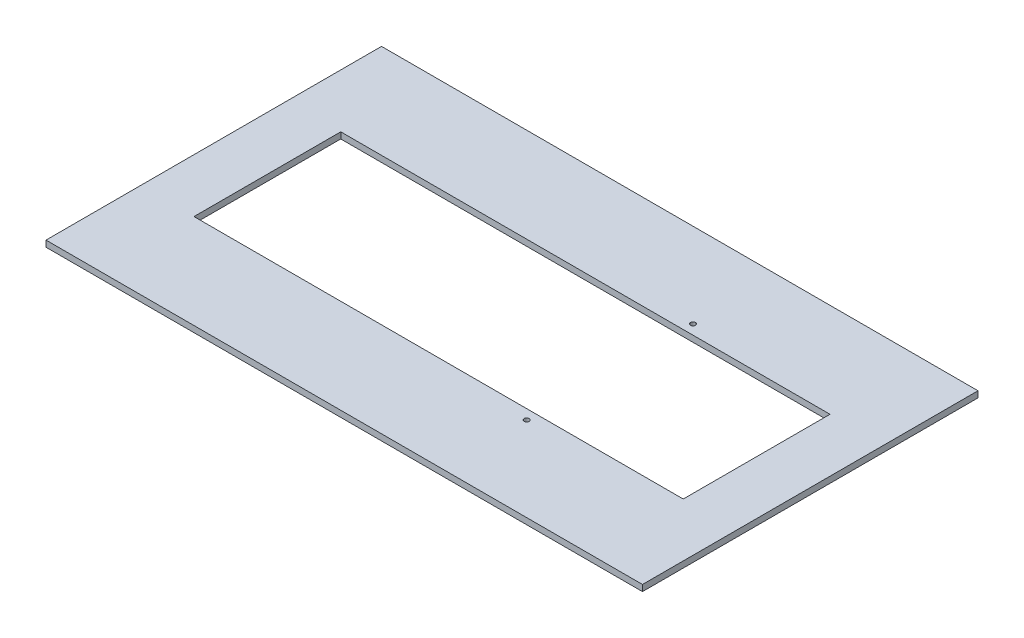
ISO-10303-21;
HEADER;
FILE_DESCRIPTION(('STEP AP214'),'2;1');
FILE_NAME('part.step','',(''),(''),'','','');
FILE_SCHEMA(('AUTOMOTIVE_DESIGN { 1 0 10303 214 1 1 1 1 }'));
ENDSEC;
DATA;
#1=APPLICATION_CONTEXT('core data for automotive mechanical design processes');
#2=APPLICATION_PROTOCOL_DEFINITION('international standard','automotive_design',2000,#1);
#3=PRODUCT_CONTEXT('',#1,'mechanical');
#4=PRODUCT('Part','Part','',(#3));
#5=PRODUCT_RELATED_PRODUCT_CATEGORY('part','',(#4));
#6=PRODUCT_DEFINITION_FORMATION('','',#4);
#7=PRODUCT_DEFINITION_CONTEXT('part definition',#1,'design');
#8=PRODUCT_DEFINITION('design','',#6,#7);
#9=PRODUCT_DEFINITION_SHAPE('','',#8);
#10=(LENGTH_UNIT() NAMED_UNIT(*) SI_UNIT(.MILLI.,.METRE.));
#11=(NAMED_UNIT(*) PLANE_ANGLE_UNIT() SI_UNIT($,.RADIAN.));
#12=(NAMED_UNIT(*) SI_UNIT($,.STERADIAN.) SOLID_ANGLE_UNIT());
#13=UNCERTAINTY_MEASURE_WITH_UNIT(LENGTH_MEASURE(1.E-05),#10,'distance_accuracy_value','');
#14=(GEOMETRIC_REPRESENTATION_CONTEXT(3) GLOBAL_UNCERTAINTY_ASSIGNED_CONTEXT((#13)) GLOBAL_UNIT_ASSIGNED_CONTEXT((#10,
#11,#12)) REPRESENTATION_CONTEXT('',''));
#15=CARTESIAN_POINT('',(0.,0.,0.));
#16=DIRECTION('',(0.,0.,1.));
#17=DIRECTION('',(1.,0.,0.));
#18=AXIS2_PLACEMENT_3D('',#15,#16,#17);
#19=CARTESIAN_POINT('',(0.,6.35,0.));
#20=DIRECTION('',(0.,-1.,0.));
#21=DIRECTION('',(0.,0.,-1.));
#22=AXIS2_PLACEMENT_3D('',#19,#20,#21);
#23=PLANE('',#22);
#24=DIRECTION('',(0.,0.,1.));
#25=VECTOR('',#24,1.);
#26=CARTESIAN_POINT('',(0.,6.35,0.));
#27=LINE('',#26,#25);
#28=CARTESIAN_POINT('',(1.50524556773939E-13,6.35,-342.9));
#29=VERTEX_POINT('',#28);
#30=CARTESIAN_POINT('',(0.,6.35,0.));
#31=VERTEX_POINT('',#30);
#32=EDGE_CURVE('E162',#29,#31,#27,.T.);
#33=ORIENTED_EDGE('',*,*,#32,.T.);
#34=DIRECTION('',(1.,0.,0.));
#35=VECTOR('',#34,1.);
#36=CARTESIAN_POINT('',(0.,6.35,0.));
#37=LINE('',#36,#35);
#38=CARTESIAN_POINT('',(609.6,6.35,0.));
#39=VERTEX_POINT('',#38);
#40=EDGE_CURVE('E166',#31,#39,#37,.T.);
#41=ORIENTED_EDGE('',*,*,#40,.T.);
#42=DIRECTION('',(0.,0.,-1.));
#43=VECTOR('',#42,1.);
#44=CARTESIAN_POINT('',(609.6,6.35,0.));
#45=LINE('',#44,#43);
#46=CARTESIAN_POINT('',(609.6,6.35,-342.9));
#47=VERTEX_POINT('',#46);
#48=EDGE_CURVE('E170',#39,#47,#45,.T.);
#49=ORIENTED_EDGE('',*,*,#48,.T.);
#50=DIRECTION('',(-1.,0.,0.));
#51=VECTOR('',#50,1.);
#52=CARTESIAN_POINT('',(1.50524556773939E-13,6.35,-342.9));
#53=LINE('',#52,#51);
#54=EDGE_CURVE('E173',#47,#29,#53,.T.);
#55=ORIENTED_EDGE('',*,*,#54,.T.);
#56=EDGE_LOOP('',(#33,#41,#49,#55));
#57=FACE_BOUND('',#56,.T.);
#58=DIRECTION('',(0.,0.,1.));
#59=VECTOR('',#58,1.);
#60=CARTESIAN_POINT('',(54.8,6.35,-246.45));
#61=LINE('',#60,#59);
#62=CARTESIAN_POINT('',(54.8,6.35,-246.45));
#63=VERTEX_POINT('',#62);
#64=CARTESIAN_POINT('',(54.8,6.35,-96.4499999999999));
#65=VERTEX_POINT('',#64);
#66=EDGE_CURVE('E111',#63,#65,#61,.T.);
#67=ORIENTED_EDGE('',*,*,#66,.F.);
#68=DIRECTION('',(-1.,0.,0.));
#69=VECTOR('',#68,1.);
#70=CARTESIAN_POINT('',(54.8,6.35,-246.45));
#71=LINE('',#70,#69);
#72=CARTESIAN_POINT('',(554.8,6.35,-246.45));
#73=VERTEX_POINT('',#72);
#74=EDGE_CURVE('E138',#73,#63,#71,.T.);
#75=ORIENTED_EDGE('',*,*,#74,.F.);
#76=DIRECTION('',(0.,0.,-1.));
#77=VECTOR('',#76,1.);
#78=CARTESIAN_POINT('',(554.8,6.35,-246.45));
#79=LINE('',#78,#77);
#80=CARTESIAN_POINT('',(554.8,6.35,-96.45));
#81=VERTEX_POINT('',#80);
#82=EDGE_CURVE('E134',#81,#73,#79,.T.);
#83=ORIENTED_EDGE('',*,*,#82,.F.);
#84=DIRECTION('',(1.,0.,0.));
#85=VECTOR('',#84,1.);
#86=CARTESIAN_POINT('',(54.8,6.35,-96.4499999999999));
#87=LINE('',#86,#85);
#88=EDGE_CURVE('E120',#65,#81,#87,.T.);
#89=ORIENTED_EDGE('',*,*,#88,.F.);
#90=EDGE_LOOP('',(#67,#75,#83,#89));
#91=FACE_BOUND('',#90,.T.);
#92=CARTESIAN_POINT('',(404.8,6.35,-256.45));
#93=DIRECTION('',(0.,1.,0.));
#94=DIRECTION('',(0.,0.,1.));
#95=AXIS2_PLACEMENT_3D('',#92,#93,#94);
#96=CIRCLE('',#95,2.55499999999998);
#97=CARTESIAN_POINT('',(404.8,6.35,-253.895));
#98=VERTEX_POINT('',#97);
#99=EDGE_CURVE('E146',#98,#98,#96,.T.);
#100=ORIENTED_EDGE('',*,*,#99,.F.);
#101=EDGE_LOOP('',(#100));
#102=FACE_BOUND('',#101,.T.);
#103=CARTESIAN_POINT('',(404.8,6.35,-86.4499999999999));
#104=DIRECTION('',(0.,1.,0.));
#105=DIRECTION('',(0.,0.,1.));
#106=AXIS2_PLACEMENT_3D('',#103,#104,#105);
#107=CIRCLE('',#106,2.55499999999998);
#108=CARTESIAN_POINT('',(404.8,6.35,-83.895));
#109=VERTEX_POINT('',#108);
#110=EDGE_CURVE('E262',#109,#109,#107,.T.);
#111=ORIENTED_EDGE('',*,*,#110,.F.);
#112=EDGE_LOOP('',(#111));
#113=FACE_BOUND('',#112,.T.);
#114=ADVANCED_FACE('F45',(#57,#91,#102,#113),#23,.F.);
#115=CARTESIAN_POINT('',(0.,0.,0.));
#116=DIRECTION('',(0.,-1.,0.));
#117=DIRECTION('',(0.,0.,-1.));
#118=AXIS2_PLACEMENT_3D('',#115,#116,#117);
#119=PLANE('',#118);
#120=CARTESIAN_POINT('',(404.8,0.,-256.45));
#121=DIRECTION('',(0.,1.,0.));
#122=DIRECTION('',(0.,0.,1.));
#123=AXIS2_PLACEMENT_3D('',#120,#121,#122);
#124=CIRCLE('',#123,2.55499999999998);
#125=CARTESIAN_POINT('',(404.8,0.,-253.895));
#126=VERTEX_POINT('',#125);
#127=EDGE_CURVE('E270',#126,#126,#124,.T.);
#128=ORIENTED_EDGE('',*,*,#127,.T.);
#129=EDGE_LOOP('',(#128));
#130=FACE_BOUND('',#129,.T.);
#131=DIRECTION('',(0.,0.,1.));
#132=VECTOR('',#131,1.);
#133=CARTESIAN_POINT('',(0.,0.,0.));
#134=LINE('',#133,#132);
#135=CARTESIAN_POINT('',(1.50524556773939E-13,0.,-342.9));
#136=VERTEX_POINT('',#135);
#137=CARTESIAN_POINT('',(0.,0.,0.));
#138=VERTEX_POINT('',#137);
#139=EDGE_CURVE('E129',#136,#138,#134,.T.);
#140=ORIENTED_EDGE('',*,*,#139,.F.);
#141=DIRECTION('',(-1.,0.,0.));
#142=VECTOR('',#141,1.);
#143=CARTESIAN_POINT('',(1.50524556773939E-13,0.,-342.9));
#144=LINE('',#143,#142);
#145=CARTESIAN_POINT('',(609.6,0.,-342.9));
#146=VERTEX_POINT('',#145);
#147=EDGE_CURVE('E167',#146,#136,#144,.T.);
#148=ORIENTED_EDGE('',*,*,#147,.F.);
#149=DIRECTION('',(0.,0.,-1.));
#150=VECTOR('',#149,1.);
#151=CARTESIAN_POINT('',(609.6,0.,0.));
#152=LINE('',#151,#150);
#153=CARTESIAN_POINT('',(609.6,0.,0.));
#154=VERTEX_POINT('',#153);
#155=EDGE_CURVE('E183',#154,#146,#152,.T.);
#156=ORIENTED_EDGE('',*,*,#155,.F.);
#157=DIRECTION('',(1.,0.,0.));
#158=VECTOR('',#157,1.);
#159=CARTESIAN_POINT('',(0.,0.,0.));
#160=LINE('',#159,#158);
#161=EDGE_CURVE('E180',#138,#154,#160,.T.);
#162=ORIENTED_EDGE('',*,*,#161,.F.);
#163=EDGE_LOOP('',(#140,#148,#156,#162));
#164=FACE_BOUND('',#163,.T.);
#165=DIRECTION('',(-1.,0.,0.));
#166=VECTOR('',#165,1.);
#167=CARTESIAN_POINT('',(54.8,0.,-246.45));
#168=LINE('',#167,#166);
#169=CARTESIAN_POINT('',(554.8,0.,-246.45));
#170=VERTEX_POINT('',#169);
#171=CARTESIAN_POINT('',(54.8,0.,-246.45));
#172=VERTEX_POINT('',#171);
#173=EDGE_CURVE('E121',#170,#172,#168,.T.);
#174=ORIENTED_EDGE('',*,*,#173,.T.);
#175=DIRECTION('',(0.,0.,1.));
#176=VECTOR('',#175,1.);
#177=CARTESIAN_POINT('',(54.8,0.,-246.45));
#178=LINE('',#177,#176);
#179=CARTESIAN_POINT('',(54.8,0.,-96.4499999999999));
#180=VERTEX_POINT('',#179);
#181=EDGE_CURVE('E69',#172,#180,#178,.T.);
#182=ORIENTED_EDGE('',*,*,#181,.T.);
#183=DIRECTION('',(1.,0.,0.));
#184=VECTOR('',#183,1.);
#185=CARTESIAN_POINT('',(54.8,0.,-96.4499999999999));
#186=LINE('',#185,#184);
#187=CARTESIAN_POINT('',(554.8,0.,-96.45));
#188=VERTEX_POINT('',#187);
#189=EDGE_CURVE('E127',#180,#188,#186,.T.);
#190=ORIENTED_EDGE('',*,*,#189,.T.);
#191=DIRECTION('',(0.,0.,-1.));
#192=VECTOR('',#191,1.);
#193=CARTESIAN_POINT('',(554.8,0.,-246.45));
#194=LINE('',#193,#192);
#195=EDGE_CURVE('E149',#188,#170,#194,.T.);
#196=ORIENTED_EDGE('',*,*,#195,.T.);
#197=EDGE_LOOP('',(#174,#182,#190,#196));
#198=FACE_BOUND('',#197,.T.);
#199=CARTESIAN_POINT('',(404.8,0.,-86.4499999999999));
#200=DIRECTION('',(0.,1.,0.));
#201=DIRECTION('',(0.,0.,1.));
#202=AXIS2_PLACEMENT_3D('',#199,#200,#201);
#203=CIRCLE('',#202,2.55499999999998);
#204=CARTESIAN_POINT('',(404.8,0.,-83.895));
#205=VERTEX_POINT('',#204);
#206=EDGE_CURVE('E265',#205,#205,#203,.T.);
#207=ORIENTED_EDGE('',*,*,#206,.T.);
#208=EDGE_LOOP('',(#207));
#209=FACE_BOUND('',#208,.T.);
#210=ADVANCED_FACE('F206',(#130,#164,#198,#209),#119,.T.);
#211=CARTESIAN_POINT('',(0.,6.35,0.));
#212=DIRECTION('',(1.,0.,0.));
#213=DIRECTION('',(0.,0.,-1.));
#214=AXIS2_PLACEMENT_3D('',#211,#212,#213);
#215=PLANE('',#214);
#216=ORIENTED_EDGE('',*,*,#139,.T.);
#217=DIRECTION('',(0.,-1.,0.));
#218=VECTOR('',#217,1.);
#219=CARTESIAN_POINT('',(0.,6.35,0.));
#220=LINE('',#219,#218);
#221=EDGE_CURVE('E11',#31,#138,#220,.T.);
#222=ORIENTED_EDGE('',*,*,#221,.F.);
#223=ORIENTED_EDGE('',*,*,#32,.F.);
#224=DIRECTION('',(0.,-1.,0.));
#225=VECTOR('',#224,1.);
#226=CARTESIAN_POINT('',(1.50524556773939E-13,6.35,-342.9));
#227=LINE('',#226,#225);
#228=EDGE_CURVE('E176',#29,#136,#227,.T.);
#229=ORIENTED_EDGE('',*,*,#228,.T.);
#230=EDGE_LOOP('',(#216,#222,#223,#229));
#231=FACE_BOUND('',#230,.T.);
#232=ADVANCED_FACE('F47',(#231),#215,.F.);
#233=CARTESIAN_POINT('',(0.,6.35,0.));
#234=DIRECTION('',(0.,0.,-1.));
#235=DIRECTION('',(-1.,0.,0.));
#236=AXIS2_PLACEMENT_3D('',#233,#234,#235);
#237=PLANE('',#236);
#238=ORIENTED_EDGE('',*,*,#161,.T.);
#239=DIRECTION('',(0.,-1.,0.));
#240=VECTOR('',#239,1.);
#241=CARTESIAN_POINT('',(609.6,6.35,0.));
#242=LINE('',#241,#240);
#243=EDGE_CURVE('E54',#39,#154,#242,.T.);
#244=ORIENTED_EDGE('',*,*,#243,.F.);
#245=ORIENTED_EDGE('',*,*,#40,.F.);
#246=ORIENTED_EDGE('',*,*,#221,.T.);
#247=EDGE_LOOP('',(#238,#244,#245,#246));
#248=FACE_BOUND('',#247,.T.);
#249=ADVANCED_FACE('F216',(#248),#237,.F.);
#250=CARTESIAN_POINT('',(609.6,6.35,0.));
#251=DIRECTION('',(-1.,0.,0.));
#252=DIRECTION('',(0.,0.,1.));
#253=AXIS2_PLACEMENT_3D('',#250,#251,#252);
#254=PLANE('',#253);
#255=ORIENTED_EDGE('',*,*,#155,.T.);
#256=DIRECTION('',(0.,-1.,0.));
#257=VECTOR('',#256,1.);
#258=CARTESIAN_POINT('',(609.6,6.35,-342.9));
#259=LINE('',#258,#257);
#260=EDGE_CURVE('E191',#47,#146,#259,.T.);
#261=ORIENTED_EDGE('',*,*,#260,.F.);
#262=ORIENTED_EDGE('',*,*,#48,.F.);
#263=ORIENTED_EDGE('',*,*,#243,.T.);
#264=EDGE_LOOP('',(#255,#261,#262,#263));
#265=FACE_BOUND('',#264,.T.);
#266=ADVANCED_FACE('F200',(#265),#254,.F.);
#267=CARTESIAN_POINT('',(1.50524556773939E-13,6.35,-342.9));
#268=DIRECTION('',(0.,0.,1.));
#269=DIRECTION('',(1.,0.,0.));
#270=AXIS2_PLACEMENT_3D('',#267,#268,#269);
#271=PLANE('',#270);
#272=ORIENTED_EDGE('',*,*,#147,.T.);
#273=ORIENTED_EDGE('',*,*,#228,.F.);
#274=ORIENTED_EDGE('',*,*,#54,.F.);
#275=ORIENTED_EDGE('',*,*,#260,.T.);
#276=EDGE_LOOP('',(#272,#273,#274,#275));
#277=FACE_BOUND('',#276,.T.);
#278=ADVANCED_FACE('F210',(#277),#271,.F.);
#279=CARTESIAN_POINT('',(54.8,6.35,-246.45));
#280=DIRECTION('',(1.,0.,0.));
#281=DIRECTION('',(0.,0.,-1.));
#282=AXIS2_PLACEMENT_3D('',#279,#280,#281);
#283=PLANE('',#282);
#284=ORIENTED_EDGE('',*,*,#181,.F.);
#285=DIRECTION('',(0.,-1.,0.));
#286=VECTOR('',#285,1.);
#287=CARTESIAN_POINT('',(54.8,6.35,-246.45));
#288=LINE('',#287,#286);
#289=EDGE_CURVE('E115',#63,#172,#288,.T.);
#290=ORIENTED_EDGE('',*,*,#289,.F.);
#291=ORIENTED_EDGE('',*,*,#66,.T.);
#292=DIRECTION('',(0.,-1.,0.));
#293=VECTOR('',#292,1.);
#294=CARTESIAN_POINT('',(54.8,6.35,-96.4499999999999));
#295=LINE('',#294,#293);
#296=EDGE_CURVE('E114',#65,#180,#295,.T.);
#297=ORIENTED_EDGE('',*,*,#296,.T.);
#298=EDGE_LOOP('',(#284,#290,#291,#297));
#299=FACE_BOUND('',#298,.T.);
#300=ADVANCED_FACE('F113',(#299),#283,.T.);
#301=CARTESIAN_POINT('',(54.8,6.35,-96.4499999999999));
#302=DIRECTION('',(0.,0.,-1.));
#303=DIRECTION('',(-1.,0.,0.));
#304=AXIS2_PLACEMENT_3D('',#301,#302,#303);
#305=PLANE('',#304);
#306=ORIENTED_EDGE('',*,*,#189,.F.);
#307=ORIENTED_EDGE('',*,*,#296,.F.);
#308=ORIENTED_EDGE('',*,*,#88,.T.);
#309=DIRECTION('',(0.,-1.,0.));
#310=VECTOR('',#309,1.);
#311=CARTESIAN_POINT('',(554.8,6.35,-96.45));
#312=LINE('',#311,#310);
#313=EDGE_CURVE('E130',#81,#188,#312,.T.);
#314=ORIENTED_EDGE('',*,*,#313,.T.);
#315=EDGE_LOOP('',(#306,#307,#308,#314));
#316=FACE_BOUND('',#315,.T.);
#317=ADVANCED_FACE('F124',(#316),#305,.T.);
#318=CARTESIAN_POINT('',(554.8,6.35,-246.45));
#319=DIRECTION('',(-1.,0.,0.));
#320=DIRECTION('',(0.,0.,1.));
#321=AXIS2_PLACEMENT_3D('',#318,#319,#320);
#322=PLANE('',#321);
#323=ORIENTED_EDGE('',*,*,#195,.F.);
#324=ORIENTED_EDGE('',*,*,#313,.F.);
#325=ORIENTED_EDGE('',*,*,#82,.T.);
#326=DIRECTION('',(0.,-1.,0.));
#327=VECTOR('',#326,1.);
#328=CARTESIAN_POINT('',(554.8,6.35,-246.45));
#329=LINE('',#328,#327);
#330=EDGE_CURVE('E61',#73,#170,#329,.T.);
#331=ORIENTED_EDGE('',*,*,#330,.T.);
#332=EDGE_LOOP('',(#323,#324,#325,#331));
#333=FACE_BOUND('',#332,.T.);
#334=ADVANCED_FACE('F240',(#333),#322,.T.);
#335=CARTESIAN_POINT('',(54.8,6.35,-246.45));
#336=DIRECTION('',(0.,0.,1.));
#337=DIRECTION('',(1.,0.,0.));
#338=AXIS2_PLACEMENT_3D('',#335,#336,#337);
#339=PLANE('',#338);
#340=ORIENTED_EDGE('',*,*,#173,.F.);
#341=ORIENTED_EDGE('',*,*,#330,.F.);
#342=ORIENTED_EDGE('',*,*,#74,.T.);
#343=ORIENTED_EDGE('',*,*,#289,.T.);
#344=EDGE_LOOP('',(#340,#341,#342,#343));
#345=FACE_BOUND('',#344,.T.);
#346=ADVANCED_FACE('F244',(#345),#339,.T.);
#347=CARTESIAN_POINT('',(404.8,6.35,-256.45));
#348=DIRECTION('',(0.,-1.,0.));
#349=DIRECTION('',(0.,0.,-1.));
#350=AXIS2_PLACEMENT_3D('',#347,#348,#349);
#351=CYLINDRICAL_SURFACE('',#350,2.55499999999998);
#352=ORIENTED_EDGE('',*,*,#99,.T.);
#353=EDGE_LOOP('',(#352));
#354=FACE_BOUND('',#353,.T.);
#355=ORIENTED_EDGE('',*,*,#127,.F.);
#356=EDGE_LOOP('',(#355));
#357=FACE_BOUND('',#356,.T.);
#358=ADVANCED_FACE('F250',(#354,#357),#351,.F.);
#359=CARTESIAN_POINT('',(404.8,6.35,-86.4499999999999));
#360=DIRECTION('',(0.,-1.,0.));
#361=DIRECTION('',(0.,0.,-1.));
#362=AXIS2_PLACEMENT_3D('',#359,#360,#361);
#363=CYLINDRICAL_SURFACE('',#362,2.55499999999998);
#364=ORIENTED_EDGE('',*,*,#110,.T.);
#365=EDGE_LOOP('',(#364));
#366=FACE_BOUND('',#365,.T.);
#367=ORIENTED_EDGE('',*,*,#206,.F.);
#368=EDGE_LOOP('',(#367));
#369=FACE_BOUND('',#368,.T.);
#370=ADVANCED_FACE('F253',(#366,#369),#363,.F.);
#371=CLOSED_SHELL('',(#114,#210,#232,#249,#266,#278,#300,#317,#334,#346,#358,#370));
#372=MANIFOLD_SOLID_BREP('B2',#371);
#373=ADVANCED_BREP_SHAPE_REPRESENTATION('',(#18,#372),#14);
#374=SHAPE_DEFINITION_REPRESENTATION(#9,#373);
ENDSEC;
END-ISO-10303-21;
